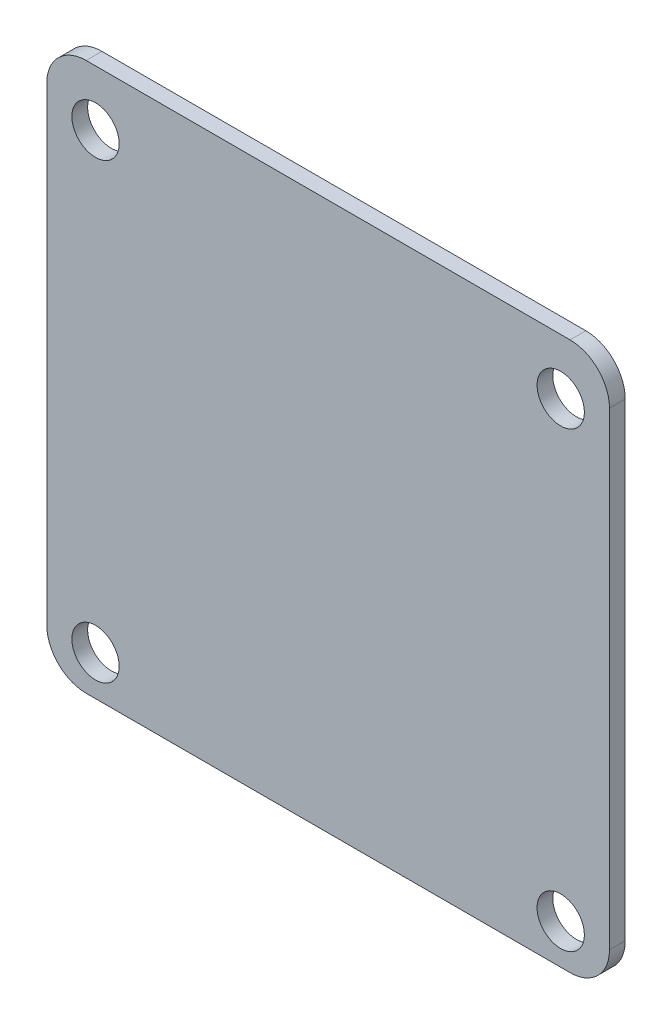
ISO-10303-21;
HEADER;
FILE_DESCRIPTION(('STEP AP214'),'2;1');
FILE_NAME('part.step','',(''),(''),'','','');
FILE_SCHEMA(('AUTOMOTIVE_DESIGN { 1 0 10303 214 1 1 1 1 }'));
ENDSEC;
DATA;
#1=APPLICATION_CONTEXT('core data for automotive mechanical design processes');
#2=APPLICATION_PROTOCOL_DEFINITION('international standard','automotive_design',2000,#1);
#3=PRODUCT_CONTEXT('',#1,'mechanical');
#4=PRODUCT('Part','Part','',(#3));
#5=PRODUCT_RELATED_PRODUCT_CATEGORY('part','',(#4));
#6=PRODUCT_DEFINITION_FORMATION('','',#4);
#7=PRODUCT_DEFINITION_CONTEXT('part definition',#1,'design');
#8=PRODUCT_DEFINITION('design','',#6,#7);
#9=PRODUCT_DEFINITION_SHAPE('','',#8);
#10=(LENGTH_UNIT() NAMED_UNIT(*) SI_UNIT(.MILLI.,.METRE.));
#11=(NAMED_UNIT(*) PLANE_ANGLE_UNIT() SI_UNIT($,.RADIAN.));
#12=(NAMED_UNIT(*) SI_UNIT($,.STERADIAN.) SOLID_ANGLE_UNIT());
#13=UNCERTAINTY_MEASURE_WITH_UNIT(LENGTH_MEASURE(1.E-05),#10,'distance_accuracy_value','');
#14=(GEOMETRIC_REPRESENTATION_CONTEXT(3) GLOBAL_UNCERTAINTY_ASSIGNED_CONTEXT((#13)) GLOBAL_UNIT_ASSIGNED_CONTEXT((#10,
#11,#12)) REPRESENTATION_CONTEXT('',''));
#15=CARTESIAN_POINT('',(0.,0.,0.));
#16=DIRECTION('',(0.,0.,1.));
#17=DIRECTION('',(1.,0.,0.));
#18=AXIS2_PLACEMENT_3D('',#15,#16,#17);
#19=CARTESIAN_POINT('',(113.101319879009,-64.52455583321,1.));
#20=DIRECTION('',(0.,0.,1.));
#21=DIRECTION('',(1.,0.,0.));
#22=AXIS2_PLACEMENT_3D('',#19,#20,#21);
#23=PLANE('',#22);
#24=CARTESIAN_POINT('',(113.694224691545,-94.2514973024652,1.));
#25=DIRECTION('',(0.,0.,1.));
#26=DIRECTION('',(1.,0.,0.));
#27=AXIS2_PLACEMENT_3D('',#24,#25,#26);
#28=CIRCLE('',#27,1.50000000000001);
#29=CARTESIAN_POINT('',(115.194224691545,-94.2514973024652,1.));
#30=VERTEX_POINT('',#29);
#31=EDGE_CURVE('E188',#30,#30,#28,.T.);
#32=ORIENTED_EDGE('',*,*,#31,.F.);
#33=EDGE_LOOP('',(#32));
#34=FACE_BOUND('',#33,.T.);
#35=CARTESIAN_POINT('',(143.194224691545,-65.5514973024652,1.));
#36=DIRECTION('',(0.,0.,1.));
#37=DIRECTION('',(1.,0.,0.));
#38=AXIS2_PLACEMENT_3D('',#35,#36,#37);
#39=CIRCLE('',#38,1.5);
#40=CARTESIAN_POINT('',(144.694224691545,-65.5514973024652,1.));
#41=VERTEX_POINT('',#40);
#42=EDGE_CURVE('E134',#41,#41,#39,.T.);
#43=ORIENTED_EDGE('',*,*,#42,.F.);
#44=EDGE_LOOP('',(#43));
#45=FACE_BOUND('',#44,.T.);
#46=CARTESIAN_POINT('',(113.101319879009,-64.52455583321,1.));
#47=DIRECTION('',(0.,0.,1.));
#48=DIRECTION('',(1.,0.,0.));
#49=AXIS2_PLACEMENT_3D('',#46,#47,#48);
#50=CIRCLE('',#49,2.50000000000001);
#51=CARTESIAN_POINT('',(113.101319879009,-62.02455583321,1.));
#52=VERTEX_POINT('',#51);
#53=CARTESIAN_POINT('',(110.601319879009,-64.52455583321,1.));
#54=VERTEX_POINT('',#53);
#55=EDGE_CURVE('E145',#52,#54,#50,.T.);
#56=ORIENTED_EDGE('',*,*,#55,.T.);
#57=DIRECTION('',(0.,-1.,0.));
#58=VECTOR('',#57,1.);
#59=CARTESIAN_POINT('',(110.601319879009,-64.52455583321,1.));
#60=LINE('',#59,#58);
#61=CARTESIAN_POINT('',(110.601319879009,-94.2784387717203,1.));
#62=VERTEX_POINT('',#61);
#63=EDGE_CURVE('E93',#54,#62,#60,.T.);
#64=ORIENTED_EDGE('',*,*,#63,.T.);
#65=CARTESIAN_POINT('',(113.101319879009,-94.2784387717203,1.));
#66=DIRECTION('',(0.,0.,1.));
#67=DIRECTION('',(1.,0.,0.));
#68=AXIS2_PLACEMENT_3D('',#65,#66,#67);
#69=CIRCLE('',#68,2.50000000000002);
#70=CARTESIAN_POINT('',(113.101319879009,-96.7784387717203,1.));
#71=VERTEX_POINT('',#70);
#72=EDGE_CURVE('E160',#62,#71,#69,.T.);
#73=ORIENTED_EDGE('',*,*,#72,.T.);
#74=DIRECTION('',(1.,0.,0.));
#75=VECTOR('',#74,1.);
#76=CARTESIAN_POINT('',(143.787129504081,-96.7784387717203,1.));
#77=LINE('',#76,#75);
#78=CARTESIAN_POINT('',(143.787129504081,-96.7784387717203,1.));
#79=VERTEX_POINT('',#78);
#80=EDGE_CURVE('E173',#71,#79,#77,.T.);
#81=ORIENTED_EDGE('',*,*,#80,.T.);
#82=CARTESIAN_POINT('',(143.787129504081,-94.2784387717203,1.));
#83=DIRECTION('',(0.,0.,1.));
#84=DIRECTION('',(1.,0.,0.));
#85=AXIS2_PLACEMENT_3D('',#82,#83,#84);
#86=CIRCLE('',#85,2.49999999999997);
#87=CARTESIAN_POINT('',(146.287129504081,-94.2784387717203,1.));
#88=VERTEX_POINT('',#87);
#89=EDGE_CURVE('E112',#79,#88,#86,.T.);
#90=ORIENTED_EDGE('',*,*,#89,.T.);
#91=DIRECTION('',(0.,1.,0.));
#92=VECTOR('',#91,1.);
#93=CARTESIAN_POINT('',(146.287129504081,-64.52455583321,1.));
#94=LINE('',#93,#92);
#95=CARTESIAN_POINT('',(146.287129504081,-64.52455583321,1.));
#96=VERTEX_POINT('',#95);
#97=EDGE_CURVE('E106',#88,#96,#94,.T.);
#98=ORIENTED_EDGE('',*,*,#97,.T.);
#99=CARTESIAN_POINT('',(143.787129504081,-64.52455583321,1.));
#100=DIRECTION('',(0.,0.,1.));
#101=DIRECTION('',(-1.,0.,0.));
#102=AXIS2_PLACEMENT_3D('',#99,#100,#101);
#103=CIRCLE('',#102,2.49999999999997);
#104=CARTESIAN_POINT('',(143.787129504081,-62.02455583321,1.));
#105=VERTEX_POINT('',#104);
#106=EDGE_CURVE('E110',#96,#105,#103,.T.);
#107=ORIENTED_EDGE('',*,*,#106,.T.);
#108=DIRECTION('',(-1.,0.,0.));
#109=VECTOR('',#108,1.);
#110=CARTESIAN_POINT('',(113.101319879009,-62.02455583321,1.));
#111=LINE('',#110,#109);
#112=EDGE_CURVE('E50',#105,#52,#111,.T.);
#113=ORIENTED_EDGE('',*,*,#112,.T.);
#114=EDGE_LOOP('',(#56,#64,#73,#81,#90,#98,#107,#113));
#115=FACE_BOUND('',#114,.T.);
#116=CARTESIAN_POINT('',(113.694224691545,-65.5514973024652,1.));
#117=DIRECTION('',(0.,0.,1.));
#118=DIRECTION('',(1.,0.,0.));
#119=AXIS2_PLACEMENT_3D('',#116,#117,#118);
#120=CIRCLE('',#119,1.50000000000001);
#121=CARTESIAN_POINT('',(115.194224691545,-65.5514973024652,1.));
#122=VERTEX_POINT('',#121);
#123=EDGE_CURVE('E182',#122,#122,#120,.T.);
#124=ORIENTED_EDGE('',*,*,#123,.F.);
#125=EDGE_LOOP('',(#124));
#126=FACE_BOUND('',#125,.T.);
#127=CARTESIAN_POINT('',(143.194224691545,-94.2514973024652,1.));
#128=DIRECTION('',(0.,0.,1.));
#129=DIRECTION('',(1.,0.,0.));
#130=AXIS2_PLACEMENT_3D('',#127,#128,#129);
#131=CIRCLE('',#130,1.50000000000002);
#132=CARTESIAN_POINT('',(144.694224691545,-94.2514973024652,1.));
#133=VERTEX_POINT('',#132);
#134=EDGE_CURVE('E194',#133,#133,#131,.T.);
#135=ORIENTED_EDGE('',*,*,#134,.F.);
#136=EDGE_LOOP('',(#135));
#137=FACE_BOUND('',#136,.T.);
#138=ADVANCED_FACE('F33',(#34,#45,#115,#126,#137),#23,.T.);
#139=CARTESIAN_POINT('',(113.101319879009,-64.52455583321,0.));
#140=DIRECTION('',(0.,0.,1.));
#141=DIRECTION('',(1.,0.,0.));
#142=AXIS2_PLACEMENT_3D('',#139,#140,#141);
#143=PLANE('',#142);
#144=CARTESIAN_POINT('',(113.101319879009,-64.52455583321,0.));
#145=DIRECTION('',(0.,0.,1.));
#146=DIRECTION('',(1.,0.,0.));
#147=AXIS2_PLACEMENT_3D('',#144,#145,#146);
#148=CIRCLE('',#147,2.50000000000001);
#149=CARTESIAN_POINT('',(113.101319879009,-62.02455583321,0.));
#150=VERTEX_POINT('',#149);
#151=CARTESIAN_POINT('',(110.601319879009,-64.52455583321,0.));
#152=VERTEX_POINT('',#151);
#153=EDGE_CURVE('E130',#150,#152,#148,.T.);
#154=ORIENTED_EDGE('',*,*,#153,.F.);
#155=DIRECTION('',(-1.,0.,0.));
#156=VECTOR('',#155,1.);
#157=CARTESIAN_POINT('',(113.101319879009,-62.02455583321,0.));
#158=LINE('',#157,#156);
#159=CARTESIAN_POINT('',(143.787129504081,-62.02455583321,0.));
#160=VERTEX_POINT('',#159);
#161=EDGE_CURVE('E85',#160,#150,#158,.T.);
#162=ORIENTED_EDGE('',*,*,#161,.F.);
#163=CARTESIAN_POINT('',(143.787129504081,-64.52455583321,0.));
#164=DIRECTION('',(0.,0.,1.));
#165=DIRECTION('',(-1.,0.,0.));
#166=AXIS2_PLACEMENT_3D('',#163,#164,#165);
#167=CIRCLE('',#166,2.49999999999997);
#168=CARTESIAN_POINT('',(146.287129504081,-64.52455583321,0.));
#169=VERTEX_POINT('',#168);
#170=EDGE_CURVE('E79',#169,#160,#167,.T.);
#171=ORIENTED_EDGE('',*,*,#170,.F.);
#172=DIRECTION('',(0.,1.,0.));
#173=VECTOR('',#172,1.);
#174=CARTESIAN_POINT('',(146.287129504081,-64.52455583321,0.));
#175=LINE('',#174,#173);
#176=CARTESIAN_POINT('',(146.287129504081,-94.2784387717203,0.));
#177=VERTEX_POINT('',#176);
#178=EDGE_CURVE('E120',#177,#169,#175,.T.);
#179=ORIENTED_EDGE('',*,*,#178,.F.);
#180=CARTESIAN_POINT('',(143.787129504081,-94.2784387717203,0.));
#181=DIRECTION('',(0.,0.,1.));
#182=DIRECTION('',(1.,0.,0.));
#183=AXIS2_PLACEMENT_3D('',#180,#181,#182);
#184=CIRCLE('',#183,2.49999999999997);
#185=CARTESIAN_POINT('',(143.787129504081,-96.7784387717203,0.));
#186=VERTEX_POINT('',#185);
#187=EDGE_CURVE('E140',#186,#177,#184,.T.);
#188=ORIENTED_EDGE('',*,*,#187,.F.);
#189=DIRECTION('',(1.,0.,0.));
#190=VECTOR('',#189,1.);
#191=CARTESIAN_POINT('',(143.787129504081,-96.7784387717203,0.));
#192=LINE('',#191,#190);
#193=CARTESIAN_POINT('',(113.101319879009,-96.7784387717203,0.));
#194=VERTEX_POINT('',#193);
#195=EDGE_CURVE('E138',#194,#186,#192,.T.);
#196=ORIENTED_EDGE('',*,*,#195,.F.);
#197=CARTESIAN_POINT('',(113.101319879009,-94.2784387717203,0.));
#198=DIRECTION('',(0.,0.,1.));
#199=DIRECTION('',(1.,0.,0.));
#200=AXIS2_PLACEMENT_3D('',#197,#198,#199);
#201=CIRCLE('',#200,2.50000000000002);
#202=CARTESIAN_POINT('',(110.601319879009,-94.2784387717203,0.));
#203=VERTEX_POINT('',#202);
#204=EDGE_CURVE('E136',#203,#194,#201,.T.);
#205=ORIENTED_EDGE('',*,*,#204,.F.);
#206=DIRECTION('',(0.,-1.,0.));
#207=VECTOR('',#206,1.);
#208=CARTESIAN_POINT('',(110.601319879009,-64.52455583321,0.));
#209=LINE('',#208,#207);
#210=EDGE_CURVE('E133',#152,#203,#209,.T.);
#211=ORIENTED_EDGE('',*,*,#210,.F.);
#212=EDGE_LOOP('',(#154,#162,#171,#179,#188,#196,#205,#211));
#213=FACE_BOUND('',#212,.T.);
#214=CARTESIAN_POINT('',(143.194224691545,-65.5514973024652,0.));
#215=DIRECTION('',(0.,0.,1.));
#216=DIRECTION('',(1.,0.,0.));
#217=AXIS2_PLACEMENT_3D('',#214,#215,#216);
#218=CIRCLE('',#217,1.5);
#219=CARTESIAN_POINT('',(144.694224691545,-65.5514973024652,0.));
#220=VERTEX_POINT('',#219);
#221=EDGE_CURVE('E179',#220,#220,#218,.T.);
#222=ORIENTED_EDGE('',*,*,#221,.T.);
#223=EDGE_LOOP('',(#222));
#224=FACE_BOUND('',#223,.T.);
#225=CARTESIAN_POINT('',(113.694224691545,-65.5514973024652,0.));
#226=DIRECTION('',(0.,0.,1.));
#227=DIRECTION('',(1.,0.,0.));
#228=AXIS2_PLACEMENT_3D('',#225,#226,#227);
#229=CIRCLE('',#228,1.50000000000001);
#230=CARTESIAN_POINT('',(115.194224691545,-65.5514973024652,0.));
#231=VERTEX_POINT('',#230);
#232=EDGE_CURVE('E185',#231,#231,#229,.T.);
#233=ORIENTED_EDGE('',*,*,#232,.T.);
#234=EDGE_LOOP('',(#233));
#235=FACE_BOUND('',#234,.T.);
#236=CARTESIAN_POINT('',(113.694224691545,-94.2514973024652,0.));
#237=DIRECTION('',(0.,0.,1.));
#238=DIRECTION('',(1.,0.,0.));
#239=AXIS2_PLACEMENT_3D('',#236,#237,#238);
#240=CIRCLE('',#239,1.50000000000001);
#241=CARTESIAN_POINT('',(115.194224691545,-94.2514973024652,0.));
#242=VERTEX_POINT('',#241);
#243=EDGE_CURVE('E191',#242,#242,#240,.T.);
#244=ORIENTED_EDGE('',*,*,#243,.T.);
#245=EDGE_LOOP('',(#244));
#246=FACE_BOUND('',#245,.T.);
#247=CARTESIAN_POINT('',(143.194224691545,-94.2514973024652,0.));
#248=DIRECTION('',(0.,0.,1.));
#249=DIRECTION('',(1.,0.,0.));
#250=AXIS2_PLACEMENT_3D('',#247,#248,#249);
#251=CIRCLE('',#250,1.50000000000002);
#252=CARTESIAN_POINT('',(144.694224691545,-94.2514973024652,0.));
#253=VERTEX_POINT('',#252);
#254=EDGE_CURVE('E197',#253,#253,#251,.T.);
#255=ORIENTED_EDGE('',*,*,#254,.T.);
#256=EDGE_LOOP('',(#255));
#257=FACE_BOUND('',#256,.T.);
#258=ADVANCED_FACE('F164',(#213,#224,#235,#246,#257),#143,.F.);
#259=CARTESIAN_POINT('',(113.101319879009,-64.52455583321,1.));
#260=DIRECTION('',(0.,0.,-1.));
#261=DIRECTION('',(-1.,0.,0.));
#262=AXIS2_PLACEMENT_3D('',#259,#260,#261);
#263=CYLINDRICAL_SURFACE('',#262,2.50000000000001);
#264=ORIENTED_EDGE('',*,*,#153,.T.);
#265=DIRECTION('',(0.,0.,-1.));
#266=VECTOR('',#265,1.);
#267=CARTESIAN_POINT('',(110.601319879009,-64.52455583321,1.));
#268=LINE('',#267,#266);
#269=EDGE_CURVE('E11',#54,#152,#268,.T.);
#270=ORIENTED_EDGE('',*,*,#269,.F.);
#271=ORIENTED_EDGE('',*,*,#55,.F.);
#272=DIRECTION('',(0.,0.,-1.));
#273=VECTOR('',#272,1.);
#274=CARTESIAN_POINT('',(113.101319879009,-62.02455583321,1.));
#275=LINE('',#274,#273);
#276=EDGE_CURVE('E126',#52,#150,#275,.T.);
#277=ORIENTED_EDGE('',*,*,#276,.T.);
#278=EDGE_LOOP('',(#264,#270,#271,#277));
#279=FACE_BOUND('',#278,.T.);
#280=ADVANCED_FACE('F35',(#279),#263,.T.);
#281=CARTESIAN_POINT('',(110.601319879009,-64.52455583321,1.));
#282=DIRECTION('',(1.,0.,0.));
#283=DIRECTION('',(0.,0.,-1.));
#284=AXIS2_PLACEMENT_3D('',#281,#282,#283);
#285=PLANE('',#284);
#286=ORIENTED_EDGE('',*,*,#210,.T.);
#287=DIRECTION('',(0.,0.,-1.));
#288=VECTOR('',#287,1.);
#289=CARTESIAN_POINT('',(110.601319879009,-94.2784387717203,1.));
#290=LINE('',#289,#288);
#291=EDGE_CURVE('E42',#62,#203,#290,.T.);
#292=ORIENTED_EDGE('',*,*,#291,.F.);
#293=ORIENTED_EDGE('',*,*,#63,.F.);
#294=ORIENTED_EDGE('',*,*,#269,.T.);
#295=EDGE_LOOP('',(#286,#292,#293,#294));
#296=FACE_BOUND('',#295,.T.);
#297=ADVANCED_FACE('F231',(#296),#285,.F.);
#298=CARTESIAN_POINT('',(113.101319879009,-94.2784387717203,1.));
#299=DIRECTION('',(0.,0.,-1.));
#300=DIRECTION('',(-1.,0.,0.));
#301=AXIS2_PLACEMENT_3D('',#298,#299,#300);
#302=CYLINDRICAL_SURFACE('',#301,2.50000000000002);
#303=ORIENTED_EDGE('',*,*,#204,.T.);
#304=DIRECTION('',(0.,0.,-1.));
#305=VECTOR('',#304,1.);
#306=CARTESIAN_POINT('',(113.101319879009,-96.7784387717203,1.));
#307=LINE('',#306,#305);
#308=EDGE_CURVE('E152',#71,#194,#307,.T.);
#309=ORIENTED_EDGE('',*,*,#308,.F.);
#310=ORIENTED_EDGE('',*,*,#72,.F.);
#311=ORIENTED_EDGE('',*,*,#291,.T.);
#312=EDGE_LOOP('',(#303,#309,#310,#311));
#313=FACE_BOUND('',#312,.T.);
#314=ADVANCED_FACE('F158',(#313),#302,.T.);
#315=CARTESIAN_POINT('',(143.787129504081,-96.7784387717203,1.));
#316=DIRECTION('',(0.,1.,0.));
#317=DIRECTION('',(0.,0.,1.));
#318=AXIS2_PLACEMENT_3D('',#315,#316,#317);
#319=PLANE('',#318);
#320=ORIENTED_EDGE('',*,*,#195,.T.);
#321=DIRECTION('',(0.,0.,-1.));
#322=VECTOR('',#321,1.);
#323=CARTESIAN_POINT('',(143.787129504081,-96.7784387717203,1.));
#324=LINE('',#323,#322);
#325=EDGE_CURVE('E149',#79,#186,#324,.T.);
#326=ORIENTED_EDGE('',*,*,#325,.F.);
#327=ORIENTED_EDGE('',*,*,#80,.F.);
#328=ORIENTED_EDGE('',*,*,#308,.T.);
#329=EDGE_LOOP('',(#320,#326,#327,#328));
#330=FACE_BOUND('',#329,.T.);
#331=ADVANCED_FACE('F169',(#330),#319,.F.);
#332=CARTESIAN_POINT('',(143.787129504081,-94.2784387717203,1.));
#333=DIRECTION('',(0.,0.,-1.));
#334=DIRECTION('',(-1.,0.,0.));
#335=AXIS2_PLACEMENT_3D('',#332,#333,#334);
#336=CYLINDRICAL_SURFACE('',#335,2.49999999999997);
#337=ORIENTED_EDGE('',*,*,#187,.T.);
#338=DIRECTION('',(0.,0.,-1.));
#339=VECTOR('',#338,1.);
#340=CARTESIAN_POINT('',(146.287129504081,-94.2784387717203,1.));
#341=LINE('',#340,#339);
#342=EDGE_CURVE('E121',#88,#177,#341,.T.);
#343=ORIENTED_EDGE('',*,*,#342,.F.);
#344=ORIENTED_EDGE('',*,*,#89,.F.);
#345=ORIENTED_EDGE('',*,*,#325,.T.);
#346=EDGE_LOOP('',(#337,#343,#344,#345));
#347=FACE_BOUND('',#346,.T.);
#348=ADVANCED_FACE('F172',(#347),#336,.T.);
#349=CARTESIAN_POINT('',(146.287129504081,-64.52455583321,1.));
#350=DIRECTION('',(-1.,0.,0.));
#351=DIRECTION('',(0.,0.,1.));
#352=AXIS2_PLACEMENT_3D('',#349,#350,#351);
#353=PLANE('',#352);
#354=ORIENTED_EDGE('',*,*,#178,.T.);
#355=DIRECTION('',(0.,0.,-1.));
#356=VECTOR('',#355,1.);
#357=CARTESIAN_POINT('',(146.287129504081,-64.52455583321,1.));
#358=LINE('',#357,#356);
#359=EDGE_CURVE('E117',#96,#169,#358,.T.);
#360=ORIENTED_EDGE('',*,*,#359,.F.);
#361=ORIENTED_EDGE('',*,*,#97,.F.);
#362=ORIENTED_EDGE('',*,*,#342,.T.);
#363=EDGE_LOOP('',(#354,#360,#361,#362));
#364=FACE_BOUND('',#363,.T.);
#365=ADVANCED_FACE('F118',(#364),#353,.F.);
#366=CARTESIAN_POINT('',(143.787129504081,-64.52455583321,1.));
#367=DIRECTION('',(0.,0.,-1.));
#368=DIRECTION('',(-1.,0.,0.));
#369=AXIS2_PLACEMENT_3D('',#366,#367,#368);
#370=CYLINDRICAL_SURFACE('',#369,2.49999999999997);
#371=ORIENTED_EDGE('',*,*,#170,.T.);
#372=DIRECTION('',(0.,0.,-1.));
#373=VECTOR('',#372,1.);
#374=CARTESIAN_POINT('',(143.787129504081,-62.02455583321,1.));
#375=LINE('',#374,#373);
#376=EDGE_CURVE('E122',#105,#160,#375,.T.);
#377=ORIENTED_EDGE('',*,*,#376,.F.);
#378=ORIENTED_EDGE('',*,*,#106,.F.);
#379=ORIENTED_EDGE('',*,*,#359,.T.);
#380=EDGE_LOOP('',(#371,#377,#378,#379));
#381=FACE_BOUND('',#380,.T.);
#382=ADVANCED_FACE('F124',(#381),#370,.T.);
#383=CARTESIAN_POINT('',(113.101319879009,-62.02455583321,1.));
#384=DIRECTION('',(0.,-1.,0.));
#385=DIRECTION('',(1.,0.,0.));
#386=AXIS2_PLACEMENT_3D('',#383,#384,#385);
#387=PLANE('',#386);
#388=ORIENTED_EDGE('',*,*,#161,.T.);
#389=ORIENTED_EDGE('',*,*,#276,.F.);
#390=ORIENTED_EDGE('',*,*,#112,.F.);
#391=ORIENTED_EDGE('',*,*,#376,.T.);
#392=EDGE_LOOP('',(#388,#389,#390,#391));
#393=FACE_BOUND('',#392,.T.);
#394=ADVANCED_FACE('F219',(#393),#387,.F.);
#395=CARTESIAN_POINT('',(143.194224691545,-65.5514973024652,1.));
#396=DIRECTION('',(0.,0.,-1.));
#397=DIRECTION('',(-1.,0.,0.));
#398=AXIS2_PLACEMENT_3D('',#395,#396,#397);
#399=CYLINDRICAL_SURFACE('',#398,1.5);
#400=ORIENTED_EDGE('',*,*,#42,.T.);
#401=EDGE_LOOP('',(#400));
#402=FACE_BOUND('',#401,.T.);
#403=ORIENTED_EDGE('',*,*,#221,.F.);
#404=EDGE_LOOP('',(#403));
#405=FACE_BOUND('',#404,.T.);
#406=ADVANCED_FACE('F216',(#402,#405),#399,.F.);
#407=CARTESIAN_POINT('',(113.694224691545,-65.5514973024652,1.));
#408=DIRECTION('',(0.,0.,-1.));
#409=DIRECTION('',(-1.,0.,0.));
#410=AXIS2_PLACEMENT_3D('',#407,#408,#409);
#411=CYLINDRICAL_SURFACE('',#410,1.50000000000001);
#412=ORIENTED_EDGE('',*,*,#123,.T.);
#413=EDGE_LOOP('',(#412));
#414=FACE_BOUND('',#413,.T.);
#415=ORIENTED_EDGE('',*,*,#232,.F.);
#416=EDGE_LOOP('',(#415));
#417=FACE_BOUND('',#416,.T.);
#418=ADVANCED_FACE('F295',(#414,#417),#411,.F.);
#419=CARTESIAN_POINT('',(113.694224691545,-94.2514973024652,1.));
#420=DIRECTION('',(0.,0.,-1.));
#421=DIRECTION('',(-1.,0.,0.));
#422=AXIS2_PLACEMENT_3D('',#419,#420,#421);
#423=CYLINDRICAL_SURFACE('',#422,1.50000000000001);
#424=ORIENTED_EDGE('',*,*,#31,.T.);
#425=EDGE_LOOP('',(#424));
#426=FACE_BOUND('',#425,.T.);
#427=ORIENTED_EDGE('',*,*,#243,.F.);
#428=EDGE_LOOP('',(#427));
#429=FACE_BOUND('',#428,.T.);
#430=ADVANCED_FACE('F303',(#426,#429),#423,.F.);
#431=CARTESIAN_POINT('',(143.194224691545,-94.2514973024652,1.));
#432=DIRECTION('',(0.,0.,-1.));
#433=DIRECTION('',(-1.,0.,0.));
#434=AXIS2_PLACEMENT_3D('',#431,#432,#433);
#435=CYLINDRICAL_SURFACE('',#434,1.50000000000002);
#436=ORIENTED_EDGE('',*,*,#134,.T.);
#437=EDGE_LOOP('',(#436));
#438=FACE_BOUND('',#437,.T.);
#439=ORIENTED_EDGE('',*,*,#254,.F.);
#440=EDGE_LOOP('',(#439));
#441=FACE_BOUND('',#440,.T.);
#442=ADVANCED_FACE('F203',(#438,#441),#435,.F.);
#443=CLOSED_SHELL('',(#138,#258,#280,#297,#314,#331,#348,#365,#382,#394,#406,#418,#430,#442));
#444=MANIFOLD_SOLID_BREP('B2',#443);
#445=ADVANCED_BREP_SHAPE_REPRESENTATION('',(#18,#444),#14);
#446=SHAPE_DEFINITION_REPRESENTATION(#9,#445);
ENDSEC;
END-ISO-10303-21;
